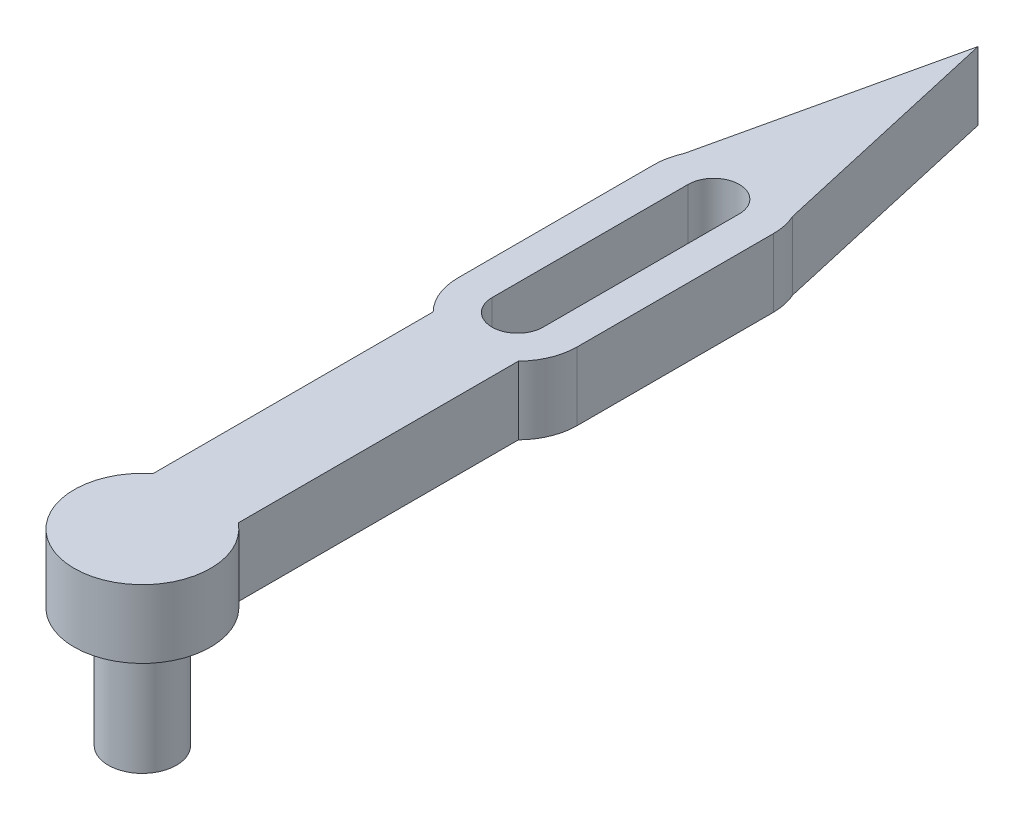
ISO-10303-21;
HEADER;
FILE_DESCRIPTION(('STEP AP214'),'2;1');
FILE_NAME('part.step','',(''),(''),'','','');
FILE_SCHEMA(('AUTOMOTIVE_DESIGN { 1 0 10303 214 1 1 1 1 }'));
ENDSEC;
DATA;
#1=APPLICATION_CONTEXT('core data for automotive mechanical design processes');
#2=APPLICATION_PROTOCOL_DEFINITION('international standard','automotive_design',2000,#1);
#3=PRODUCT_CONTEXT('',#1,'mechanical');
#4=PRODUCT('Part','Part','',(#3));
#5=PRODUCT_RELATED_PRODUCT_CATEGORY('part','',(#4));
#6=PRODUCT_DEFINITION_FORMATION('','',#4);
#7=PRODUCT_DEFINITION_CONTEXT('part definition',#1,'design');
#8=PRODUCT_DEFINITION('design','',#6,#7);
#9=PRODUCT_DEFINITION_SHAPE('','',#8);
#10=(LENGTH_UNIT() NAMED_UNIT(*) SI_UNIT(.MILLI.,.METRE.));
#11=(NAMED_UNIT(*) PLANE_ANGLE_UNIT() SI_UNIT($,.RADIAN.));
#12=(NAMED_UNIT(*) SI_UNIT($,.STERADIAN.) SOLID_ANGLE_UNIT());
#13=UNCERTAINTY_MEASURE_WITH_UNIT(LENGTH_MEASURE(1.E-05),#10,'distance_accuracy_value','');
#14=(GEOMETRIC_REPRESENTATION_CONTEXT(3) GLOBAL_UNCERTAINTY_ASSIGNED_CONTEXT((#13)) GLOBAL_UNIT_ASSIGNED_CONTEXT((#10,
#11,#12)) REPRESENTATION_CONTEXT('',''));
#15=CARTESIAN_POINT('',(0.,0.,0.));
#16=DIRECTION('',(0.,0.,1.));
#17=DIRECTION('',(1.,0.,0.));
#18=AXIS2_PLACEMENT_3D('',#15,#16,#17);
#19=CARTESIAN_POINT('',(0.,0.,-67.));
#20=DIRECTION('',(0.,-1.,0.));
#21=DIRECTION('',(0.,0.,-1.));
#22=AXIS2_PLACEMENT_3D('',#19,#20,#21);
#23=PLANE('',#22);
#24=DIRECTION('',(0.,0.,-1.));
#25=VECTOR('',#24,1.);
#26=CARTESIAN_POINT('',(3.,0.,-67.));
#27=LINE('',#26,#25);
#28=CARTESIAN_POINT('',(3.,0.,-44.));
#29=VERTEX_POINT('',#28);
#30=CARTESIAN_POINT('',(3.,0.,-67.));
#31=VERTEX_POINT('',#30);
#32=EDGE_CURVE('E149',#29,#31,#27,.T.);
#33=ORIENTED_EDGE('',*,*,#32,.T.);
#34=CARTESIAN_POINT('',(0.,0.,-67.));
#35=DIRECTION('',(0.,1.,0.));
#36=DIRECTION('',(0.,0.,1.));
#37=AXIS2_PLACEMENT_3D('',#34,#35,#36);
#38=CIRCLE('',#37,3.);
#39=CARTESIAN_POINT('',(-3.,0.,-67.));
#40=VERTEX_POINT('',#39);
#41=EDGE_CURVE('E56',#31,#40,#38,.T.);
#42=ORIENTED_EDGE('',*,*,#41,.T.);
#43=DIRECTION('',(0.,0.,1.));
#44=VECTOR('',#43,1.);
#45=CARTESIAN_POINT('',(-3.,0.,-67.));
#46=LINE('',#45,#44);
#47=CARTESIAN_POINT('',(-3.,0.,-44.));
#48=VERTEX_POINT('',#47);
#49=EDGE_CURVE('E155',#40,#48,#46,.T.);
#50=ORIENTED_EDGE('',*,*,#49,.T.);
#51=CARTESIAN_POINT('',(0.,0.,-44.));
#52=DIRECTION('',(0.,1.,0.));
#53=DIRECTION('',(0.,0.,1.));
#54=AXIS2_PLACEMENT_3D('',#51,#52,#53);
#55=CIRCLE('',#54,3.);
#56=EDGE_CURVE('E171',#48,#29,#55,.T.);
#57=ORIENTED_EDGE('',*,*,#56,.T.);
#58=EDGE_LOOP('',(#33,#42,#50,#57));
#59=FACE_BOUND('',#58,.T.);
#60=DIRECTION('',(-0.221230674548458,0.,-0.975221507473474));
#61=VECTOR('',#60,1.);
#62=CARTESIAN_POINT('',(6.37803807647604,0.,-69.8845502760434));
#63=LINE('',#62,#61);
#64=CARTESIAN_POINT('',(6.37803807647603,0.,-69.8845502760434));
#65=VERTEX_POINT('',#64);
#66=CARTESIAN_POINT('',(0.,0.,-98.));
#67=VERTEX_POINT('',#66);
#68=EDGE_CURVE('E156',#65,#67,#63,.T.);
#69=ORIENTED_EDGE('',*,*,#68,.F.);
#70=CARTESIAN_POINT('',(0.,0.,-67.));
#71=DIRECTION('',(0.,1.,0.));
#72=DIRECTION('',(0.,0.,1.));
#73=AXIS2_PLACEMENT_3D('',#70,#71,#72);
#74=CIRCLE('',#73,7.);
#75=CARTESIAN_POINT('',(7.,0.,-67.));
#76=VERTEX_POINT('',#75);
#77=EDGE_CURVE('E183',#76,#65,#74,.T.);
#78=ORIENTED_EDGE('',*,*,#77,.F.);
#79=DIRECTION('',(0.,0.,-1.));
#80=VECTOR('',#79,1.);
#81=CARTESIAN_POINT('',(7.,0.,-44.));
#82=LINE('',#81,#80);
#83=CARTESIAN_POINT('',(7.,0.,-44.));
#84=VERTEX_POINT('',#83);
#85=EDGE_CURVE('E222',#84,#76,#82,.T.);
#86=ORIENTED_EDGE('',*,*,#85,.F.);
#87=CARTESIAN_POINT('',(0.,0.,-44.));
#88=DIRECTION('',(0.,1.,0.));
#89=DIRECTION('',(0.,0.,-1.));
#90=AXIS2_PLACEMENT_3D('',#87,#88,#89);
#91=CIRCLE('',#90,7.);
#92=CARTESIAN_POINT('',(5.,0.,-39.1010205144336));
#93=VERTEX_POINT('',#92);
#94=EDGE_CURVE('E220',#93,#84,#91,.T.);
#95=ORIENTED_EDGE('',*,*,#94,.F.);
#96=DIRECTION('',(0.,0.,-1.));
#97=VECTOR('',#96,1.);
#98=CARTESIAN_POINT('',(5.,0.,-6.2449979983984));
#99=LINE('',#98,#97);
#100=CARTESIAN_POINT('',(5.,0.,-6.2449979983984));
#101=VERTEX_POINT('',#100);
#102=EDGE_CURVE('E218',#101,#93,#99,.T.);
#103=ORIENTED_EDGE('',*,*,#102,.F.);
#104=CARTESIAN_POINT('',(0.,0.,0.));
#105=DIRECTION('',(0.,1.,0.));
#106=DIRECTION('',(0.,0.,1.));
#107=AXIS2_PLACEMENT_3D('',#104,#105,#106);
#108=CIRCLE('',#107,8.);
#109=CARTESIAN_POINT('',(-5.,0.,-6.2449979983984));
#110=VERTEX_POINT('',#109);
#111=EDGE_CURVE('E216',#110,#101,#108,.T.);
#112=ORIENTED_EDGE('',*,*,#111,.F.);
#113=DIRECTION('',(0.,0.,1.));
#114=VECTOR('',#113,1.);
#115=CARTESIAN_POINT('',(-5.,0.,-6.2449979983984));
#116=LINE('',#115,#114);
#117=CARTESIAN_POINT('',(-5.,0.,-39.1010205144336));
#118=VERTEX_POINT('',#117);
#119=EDGE_CURVE('E214',#118,#110,#116,.T.);
#120=ORIENTED_EDGE('',*,*,#119,.F.);
#121=CARTESIAN_POINT('',(0.,0.,-44.));
#122=DIRECTION('',(0.,1.,0.));
#123=DIRECTION('',(0.,0.,1.));
#124=AXIS2_PLACEMENT_3D('',#121,#122,#123);
#125=CIRCLE('',#124,7.);
#126=CARTESIAN_POINT('',(-7.,0.,-44.));
#127=VERTEX_POINT('',#126);
#128=EDGE_CURVE('E212',#127,#118,#125,.T.);
#129=ORIENTED_EDGE('',*,*,#128,.F.);
#130=DIRECTION('',(0.,0.,1.));
#131=VECTOR('',#130,1.);
#132=CARTESIAN_POINT('',(-7.,0.,-44.));
#133=LINE('',#132,#131);
#134=CARTESIAN_POINT('',(-7.,0.,-67.));
#135=VERTEX_POINT('',#134);
#136=EDGE_CURVE('E210',#135,#127,#133,.T.);
#137=ORIENTED_EDGE('',*,*,#136,.F.);
#138=CARTESIAN_POINT('',(0.,0.,-67.));
#139=DIRECTION('',(0.,1.,0.));
#140=DIRECTION('',(0.,0.,-1.));
#141=AXIS2_PLACEMENT_3D('',#138,#139,#140);
#142=CIRCLE('',#141,7.);
#143=CARTESIAN_POINT('',(-6.37803807647604,0.,-69.8845502760434));
#144=VERTEX_POINT('',#143);
#145=EDGE_CURVE('E208',#144,#135,#142,.T.);
#146=ORIENTED_EDGE('',*,*,#145,.F.);
#147=DIRECTION('',(-0.221230674548458,0.,0.975221507473474));
#148=VECTOR('',#147,1.);
#149=CARTESIAN_POINT('',(-6.37803807647604,0.,-69.8845502760434));
#150=LINE('',#149,#148);
#151=EDGE_CURVE('E206',#67,#144,#150,.T.);
#152=ORIENTED_EDGE('',*,*,#151,.F.);
#153=EDGE_LOOP('',(#69,#78,#86,#95,#103,#112,#120,#129,#137,#146,#152));
#154=FACE_BOUND('',#153,.T.);
#155=CARTESIAN_POINT('',(0.,0.,0.));
#156=DIRECTION('',(0.,-1.,0.));
#157=DIRECTION('',(0.,0.,-1.));
#158=AXIS2_PLACEMENT_3D('',#155,#156,#157);
#159=CIRCLE('',#158,4.);
#160=CARTESIAN_POINT('',(0.,0.,-4.));
#161=VERTEX_POINT('',#160);
#162=EDGE_CURVE('E466',#161,#161,#159,.T.);
#163=ORIENTED_EDGE('',*,*,#162,.F.);
#164=EDGE_LOOP('',(#163));
#165=FACE_BOUND('',#164,.T.);
#166=ADVANCED_FACE('F33',(#59,#154,#165),#23,.T.);
#167=CARTESIAN_POINT('',(0.,8.,-67.));
#168=DIRECTION('',(0.,-1.,0.));
#169=DIRECTION('',(0.,0.,-1.));
#170=AXIS2_PLACEMENT_3D('',#167,#168,#169);
#171=PLANE('',#170);
#172=DIRECTION('',(-0.221230674548458,0.,-0.975221507473474));
#173=VECTOR('',#172,1.);
#174=CARTESIAN_POINT('',(6.37803807647604,8.,-69.8845502760434));
#175=LINE('',#174,#173);
#176=CARTESIAN_POINT('',(6.37803807647603,8.,-69.8845502760434));
#177=VERTEX_POINT('',#176);
#178=CARTESIAN_POINT('',(0.,8.,-98.));
#179=VERTEX_POINT('',#178);
#180=EDGE_CURVE('E179',#177,#179,#175,.T.);
#181=ORIENTED_EDGE('',*,*,#180,.T.);
#182=DIRECTION('',(-0.221230674548458,0.,0.975221507473474));
#183=VECTOR('',#182,1.);
#184=CARTESIAN_POINT('',(-6.37803807647604,8.,-69.8845502760434));
#185=LINE('',#184,#183);
#186=CARTESIAN_POINT('',(-6.37803807647604,8.,-69.8845502760434));
#187=VERTEX_POINT('',#186);
#188=EDGE_CURVE('E182',#179,#187,#185,.T.);
#189=ORIENTED_EDGE('',*,*,#188,.T.);
#190=CARTESIAN_POINT('',(0.,8.,-67.));
#191=DIRECTION('',(0.,1.,0.));
#192=DIRECTION('',(0.,0.,-1.));
#193=AXIS2_PLACEMENT_3D('',#190,#191,#192);
#194=CIRCLE('',#193,7.);
#195=CARTESIAN_POINT('',(-7.,8.,-67.));
#196=VERTEX_POINT('',#195);
#197=EDGE_CURVE('E185',#187,#196,#194,.T.);
#198=ORIENTED_EDGE('',*,*,#197,.T.);
#199=DIRECTION('',(0.,0.,1.));
#200=VECTOR('',#199,1.);
#201=CARTESIAN_POINT('',(-7.,8.,-44.));
#202=LINE('',#201,#200);
#203=CARTESIAN_POINT('',(-7.,8.,-44.));
#204=VERTEX_POINT('',#203);
#205=EDGE_CURVE('E187',#196,#204,#202,.T.);
#206=ORIENTED_EDGE('',*,*,#205,.T.);
#207=CARTESIAN_POINT('',(0.,8.,-44.));
#208=DIRECTION('',(0.,1.,0.));
#209=DIRECTION('',(0.,0.,1.));
#210=AXIS2_PLACEMENT_3D('',#207,#208,#209);
#211=CIRCLE('',#210,7.);
#212=CARTESIAN_POINT('',(-5.,8.,-39.1010205144336));
#213=VERTEX_POINT('',#212);
#214=EDGE_CURVE('E189',#204,#213,#211,.T.);
#215=ORIENTED_EDGE('',*,*,#214,.T.);
#216=DIRECTION('',(0.,0.,1.));
#217=VECTOR('',#216,1.);
#218=CARTESIAN_POINT('',(-5.,8.,-6.2449979983984));
#219=LINE('',#218,#217);
#220=CARTESIAN_POINT('',(-5.,8.,-6.2449979983984));
#221=VERTEX_POINT('',#220);
#222=EDGE_CURVE('E191',#213,#221,#219,.T.);
#223=ORIENTED_EDGE('',*,*,#222,.T.);
#224=CARTESIAN_POINT('',(0.,8.,0.));
#225=DIRECTION('',(0.,1.,0.));
#226=DIRECTION('',(0.,0.,1.));
#227=AXIS2_PLACEMENT_3D('',#224,#225,#226);
#228=CIRCLE('',#227,8.);
#229=CARTESIAN_POINT('',(5.,8.,-6.2449979983984));
#230=VERTEX_POINT('',#229);
#231=EDGE_CURVE('E193',#221,#230,#228,.T.);
#232=ORIENTED_EDGE('',*,*,#231,.T.);
#233=DIRECTION('',(0.,0.,-1.));
#234=VECTOR('',#233,1.);
#235=CARTESIAN_POINT('',(5.,8.,-6.2449979983984));
#236=LINE('',#235,#234);
#237=CARTESIAN_POINT('',(5.,8.,-39.1010205144336));
#238=VERTEX_POINT('',#237);
#239=EDGE_CURVE('E195',#230,#238,#236,.T.);
#240=ORIENTED_EDGE('',*,*,#239,.T.);
#241=CARTESIAN_POINT('',(0.,8.,-44.));
#242=DIRECTION('',(0.,1.,0.));
#243=DIRECTION('',(0.,0.,-1.));
#244=AXIS2_PLACEMENT_3D('',#241,#242,#243);
#245=CIRCLE('',#244,7.);
#246=CARTESIAN_POINT('',(7.,8.,-44.));
#247=VERTEX_POINT('',#246);
#248=EDGE_CURVE('E197',#238,#247,#245,.T.);
#249=ORIENTED_EDGE('',*,*,#248,.T.);
#250=DIRECTION('',(0.,0.,-1.));
#251=VECTOR('',#250,1.);
#252=CARTESIAN_POINT('',(7.,8.,-44.));
#253=LINE('',#252,#251);
#254=CARTESIAN_POINT('',(7.,8.,-67.));
#255=VERTEX_POINT('',#254);
#256=EDGE_CURVE('E199',#247,#255,#253,.T.);
#257=ORIENTED_EDGE('',*,*,#256,.T.);
#258=CARTESIAN_POINT('',(0.,8.,-67.));
#259=DIRECTION('',(0.,1.,0.));
#260=DIRECTION('',(0.,0.,1.));
#261=AXIS2_PLACEMENT_3D('',#258,#259,#260);
#262=CIRCLE('',#261,7.);
#263=EDGE_CURVE('E201',#255,#177,#262,.T.);
#264=ORIENTED_EDGE('',*,*,#263,.T.);
#265=EDGE_LOOP('',(#181,#189,#198,#206,#215,#223,#232,#240,#249,#257,#264));
#266=FACE_BOUND('',#265,.T.);
#267=CARTESIAN_POINT('',(0.,8.,-67.));
#268=DIRECTION('',(0.,1.,0.));
#269=DIRECTION('',(0.,0.,1.));
#270=AXIS2_PLACEMENT_3D('',#267,#268,#269);
#271=CIRCLE('',#270,3.);
#272=CARTESIAN_POINT('',(3.,8.,-67.));
#273=VERTEX_POINT('',#272);
#274=CARTESIAN_POINT('',(-3.,8.,-67.));
#275=VERTEX_POINT('',#274);
#276=EDGE_CURVE('E140',#273,#275,#271,.T.);
#277=ORIENTED_EDGE('',*,*,#276,.F.);
#278=DIRECTION('',(0.,0.,-1.));
#279=VECTOR('',#278,1.);
#280=CARTESIAN_POINT('',(3.,8.,-67.));
#281=LINE('',#280,#279);
#282=CARTESIAN_POINT('',(3.,8.,-44.));
#283=VERTEX_POINT('',#282);
#284=EDGE_CURVE('E163',#283,#273,#281,.T.);
#285=ORIENTED_EDGE('',*,*,#284,.F.);
#286=CARTESIAN_POINT('',(0.,8.,-44.));
#287=DIRECTION('',(0.,1.,0.));
#288=DIRECTION('',(0.,0.,1.));
#289=AXIS2_PLACEMENT_3D('',#286,#287,#288);
#290=CIRCLE('',#289,3.);
#291=CARTESIAN_POINT('',(-3.,8.,-44.));
#292=VERTEX_POINT('',#291);
#293=EDGE_CURVE('E161',#292,#283,#290,.T.);
#294=ORIENTED_EDGE('',*,*,#293,.F.);
#295=DIRECTION('',(0.,0.,1.));
#296=VECTOR('',#295,1.);
#297=CARTESIAN_POINT('',(-3.,8.,-67.));
#298=LINE('',#297,#296);
#299=EDGE_CURVE('E148',#275,#292,#298,.T.);
#300=ORIENTED_EDGE('',*,*,#299,.F.);
#301=EDGE_LOOP('',(#277,#285,#294,#300));
#302=FACE_BOUND('',#301,.T.);
#303=ADVANCED_FACE('F160',(#266,#302),#171,.F.);
#304=CARTESIAN_POINT('',(6.37803807647604,8.,-69.8845502760434));
#305=DIRECTION('',(-0.975221507473474,0.,0.221230674548458));
#306=DIRECTION('',(0.221230674548458,0.,0.975221507473474));
#307=AXIS2_PLACEMENT_3D('',#304,#305,#306);
#308=PLANE('',#307);
#309=ORIENTED_EDGE('',*,*,#68,.T.);
#310=DIRECTION('',(0.,-1.,0.));
#311=VECTOR('',#310,1.);
#312=CARTESIAN_POINT('',(0.,8.,-98.));
#313=LINE('',#312,#311);
#314=EDGE_CURVE('E11',#179,#67,#313,.T.);
#315=ORIENTED_EDGE('',*,*,#314,.F.);
#316=ORIENTED_EDGE('',*,*,#180,.F.);
#317=DIRECTION('',(0.,-1.,0.));
#318=VECTOR('',#317,1.);
#319=CARTESIAN_POINT('',(6.37803807647603,8.,-69.8845502760434));
#320=LINE('',#319,#318);
#321=EDGE_CURVE('E203',#177,#65,#320,.T.);
#322=ORIENTED_EDGE('',*,*,#321,.T.);
#323=EDGE_LOOP('',(#309,#315,#316,#322));
#324=FACE_BOUND('',#323,.T.);
#325=ADVANCED_FACE('F35',(#324),#308,.F.);
#326=CARTESIAN_POINT('',(-6.37803807647604,8.,-69.8845502760434));
#327=DIRECTION('',(0.975221507473474,0.,0.221230674548458));
#328=DIRECTION('',(0.221230674548458,0.,-0.975221507473474));
#329=AXIS2_PLACEMENT_3D('',#326,#327,#328);
#330=PLANE('',#329);
#331=ORIENTED_EDGE('',*,*,#151,.T.);
#332=DIRECTION('',(0.,-1.,0.));
#333=VECTOR('',#332,1.);
#334=CARTESIAN_POINT('',(-6.37803807647604,8.,-69.8845502760434));
#335=LINE('',#334,#333);
#336=EDGE_CURVE('E41',#187,#144,#335,.T.);
#337=ORIENTED_EDGE('',*,*,#336,.F.);
#338=ORIENTED_EDGE('',*,*,#188,.F.);
#339=ORIENTED_EDGE('',*,*,#314,.T.);
#340=EDGE_LOOP('',(#331,#337,#338,#339));
#341=FACE_BOUND('',#340,.T.);
#342=ADVANCED_FACE('F277',(#341),#330,.F.);
#343=CARTESIAN_POINT('',(0.,8.,-67.));
#344=DIRECTION('',(0.,-1.,0.));
#345=DIRECTION('',(0.,0.,-1.));
#346=AXIS2_PLACEMENT_3D('',#343,#344,#345);
#347=CYLINDRICAL_SURFACE('',#346,7.);
#348=ORIENTED_EDGE('',*,*,#145,.T.);
#349=DIRECTION('',(0.,-1.,0.));
#350=VECTOR('',#349,1.);
#351=CARTESIAN_POINT('',(-7.,8.,-67.));
#352=LINE('',#351,#350);
#353=EDGE_CURVE('E248',#196,#135,#352,.T.);
#354=ORIENTED_EDGE('',*,*,#353,.F.);
#355=ORIENTED_EDGE('',*,*,#197,.F.);
#356=ORIENTED_EDGE('',*,*,#336,.T.);
#357=EDGE_LOOP('',(#348,#354,#355,#356));
#358=FACE_BOUND('',#357,.T.);
#359=ADVANCED_FACE('F255',(#358),#347,.T.);
#360=CARTESIAN_POINT('',(-7.,8.,-44.));
#361=DIRECTION('',(1.,0.,0.));
#362=DIRECTION('',(0.,0.,-1.));
#363=AXIS2_PLACEMENT_3D('',#360,#361,#362);
#364=PLANE('',#363);
#365=ORIENTED_EDGE('',*,*,#136,.T.);
#366=DIRECTION('',(0.,-1.,0.));
#367=VECTOR('',#366,1.);
#368=CARTESIAN_POINT('',(-7.,8.,-44.));
#369=LINE('',#368,#367);
#370=EDGE_CURVE('E245',#204,#127,#369,.T.);
#371=ORIENTED_EDGE('',*,*,#370,.F.);
#372=ORIENTED_EDGE('',*,*,#205,.F.);
#373=ORIENTED_EDGE('',*,*,#353,.T.);
#374=EDGE_LOOP('',(#365,#371,#372,#373));
#375=FACE_BOUND('',#374,.T.);
#376=ADVANCED_FACE('F266',(#375),#364,.F.);
#377=CARTESIAN_POINT('',(0.,8.,-44.));
#378=DIRECTION('',(0.,-1.,0.));
#379=DIRECTION('',(0.,0.,-1.));
#380=AXIS2_PLACEMENT_3D('',#377,#378,#379);
#381=CYLINDRICAL_SURFACE('',#380,7.);
#382=ORIENTED_EDGE('',*,*,#128,.T.);
#383=DIRECTION('',(0.,-1.,0.));
#384=VECTOR('',#383,1.);
#385=CARTESIAN_POINT('',(-5.,8.,-39.1010205144336));
#386=LINE('',#385,#384);
#387=EDGE_CURVE('E242',#213,#118,#386,.T.);
#388=ORIENTED_EDGE('',*,*,#387,.F.);
#389=ORIENTED_EDGE('',*,*,#214,.F.);
#390=ORIENTED_EDGE('',*,*,#370,.T.);
#391=EDGE_LOOP('',(#382,#388,#389,#390));
#392=FACE_BOUND('',#391,.T.);
#393=ADVANCED_FACE('F270',(#392),#381,.T.);
#394=CARTESIAN_POINT('',(-5.,8.,-6.2449979983984));
#395=DIRECTION('',(1.,0.,0.));
#396=DIRECTION('',(0.,0.,-1.));
#397=AXIS2_PLACEMENT_3D('',#394,#395,#396);
#398=PLANE('',#397);
#399=ORIENTED_EDGE('',*,*,#119,.T.);
#400=DIRECTION('',(0.,-1.,0.));
#401=VECTOR('',#400,1.);
#402=CARTESIAN_POINT('',(-5.,8.,-6.2449979983984));
#403=LINE('',#402,#401);
#404=EDGE_CURVE('E239',#221,#110,#403,.T.);
#405=ORIENTED_EDGE('',*,*,#404,.F.);
#406=ORIENTED_EDGE('',*,*,#222,.F.);
#407=ORIENTED_EDGE('',*,*,#387,.T.);
#408=EDGE_LOOP('',(#399,#405,#406,#407));
#409=FACE_BOUND('',#408,.T.);
#410=ADVANCED_FACE('F305',(#409),#398,.F.);
#411=CARTESIAN_POINT('',(0.,8.,0.));
#412=DIRECTION('',(0.,-1.,0.));
#413=DIRECTION('',(0.,0.,-1.));
#414=AXIS2_PLACEMENT_3D('',#411,#412,#413);
#415=CYLINDRICAL_SURFACE('',#414,8.);
#416=ORIENTED_EDGE('',*,*,#111,.T.);
#417=DIRECTION('',(0.,-1.,0.));
#418=VECTOR('',#417,1.);
#419=CARTESIAN_POINT('',(5.,8.,-6.2449979983984));
#420=LINE('',#419,#418);
#421=EDGE_CURVE('E236',#230,#101,#420,.T.);
#422=ORIENTED_EDGE('',*,*,#421,.F.);
#423=ORIENTED_EDGE('',*,*,#231,.F.);
#424=ORIENTED_EDGE('',*,*,#404,.T.);
#425=EDGE_LOOP('',(#416,#422,#423,#424));
#426=FACE_BOUND('',#425,.T.);
#427=ADVANCED_FACE('F303',(#426),#415,.T.);
#428=CARTESIAN_POINT('',(5.,8.,-6.2449979983984));
#429=DIRECTION('',(-1.,0.,0.));
#430=DIRECTION('',(0.,0.,1.));
#431=AXIS2_PLACEMENT_3D('',#428,#429,#430);
#432=PLANE('',#431);
#433=ORIENTED_EDGE('',*,*,#102,.T.);
#434=DIRECTION('',(0.,-1.,0.));
#435=VECTOR('',#434,1.);
#436=CARTESIAN_POINT('',(5.,8.,-39.1010205144336));
#437=LINE('',#436,#435);
#438=EDGE_CURVE('E233',#238,#93,#437,.T.);
#439=ORIENTED_EDGE('',*,*,#438,.F.);
#440=ORIENTED_EDGE('',*,*,#239,.F.);
#441=ORIENTED_EDGE('',*,*,#421,.T.);
#442=EDGE_LOOP('',(#433,#439,#440,#441));
#443=FACE_BOUND('',#442,.T.);
#444=ADVANCED_FACE('F298',(#443),#432,.F.);
#445=CARTESIAN_POINT('',(0.,8.,-44.));
#446=DIRECTION('',(0.,-1.,0.));
#447=DIRECTION('',(0.,0.,-1.));
#448=AXIS2_PLACEMENT_3D('',#445,#446,#447);
#449=CYLINDRICAL_SURFACE('',#448,7.);
#450=ORIENTED_EDGE('',*,*,#94,.T.);
#451=DIRECTION('',(0.,-1.,0.));
#452=VECTOR('',#451,1.);
#453=CARTESIAN_POINT('',(7.,8.,-44.));
#454=LINE('',#453,#452);
#455=EDGE_CURVE('E230',#247,#84,#454,.T.);
#456=ORIENTED_EDGE('',*,*,#455,.F.);
#457=ORIENTED_EDGE('',*,*,#248,.F.);
#458=ORIENTED_EDGE('',*,*,#438,.T.);
#459=EDGE_LOOP('',(#450,#456,#457,#458));
#460=FACE_BOUND('',#459,.T.);
#461=ADVANCED_FACE('F293',(#460),#449,.T.);
#462=CARTESIAN_POINT('',(7.,8.,-44.));
#463=DIRECTION('',(-1.,0.,0.));
#464=DIRECTION('',(0.,0.,1.));
#465=AXIS2_PLACEMENT_3D('',#462,#463,#464);
#466=PLANE('',#465);
#467=ORIENTED_EDGE('',*,*,#85,.T.);
#468=DIRECTION('',(0.,-1.,0.));
#469=VECTOR('',#468,1.);
#470=CARTESIAN_POINT('',(7.,8.,-67.));
#471=LINE('',#470,#469);
#472=EDGE_CURVE('E227',#255,#76,#471,.T.);
#473=ORIENTED_EDGE('',*,*,#472,.F.);
#474=ORIENTED_EDGE('',*,*,#256,.F.);
#475=ORIENTED_EDGE('',*,*,#455,.T.);
#476=EDGE_LOOP('',(#467,#473,#474,#475));
#477=FACE_BOUND('',#476,.T.);
#478=ADVANCED_FACE('F289',(#477),#466,.F.);
#479=CARTESIAN_POINT('',(0.,8.,-67.));
#480=DIRECTION('',(0.,-1.,0.));
#481=DIRECTION('',(0.,0.,-1.));
#482=AXIS2_PLACEMENT_3D('',#479,#480,#481);
#483=CYLINDRICAL_SURFACE('',#482,7.);
#484=ORIENTED_EDGE('',*,*,#77,.T.);
#485=ORIENTED_EDGE('',*,*,#321,.F.);
#486=ORIENTED_EDGE('',*,*,#263,.F.);
#487=ORIENTED_EDGE('',*,*,#472,.T.);
#488=EDGE_LOOP('',(#484,#485,#486,#487));
#489=FACE_BOUND('',#488,.T.);
#490=ADVANCED_FACE('F284',(#489),#483,.T.);
#491=CARTESIAN_POINT('',(0.,8.,-67.));
#492=DIRECTION('',(0.,-1.,0.));
#493=DIRECTION('',(0.,0.,-1.));
#494=AXIS2_PLACEMENT_3D('',#491,#492,#493);
#495=CYLINDRICAL_SURFACE('',#494,3.);
#496=ORIENTED_EDGE('',*,*,#41,.F.);
#497=DIRECTION('',(0.,-1.,0.));
#498=VECTOR('',#497,1.);
#499=CARTESIAN_POINT('',(3.,8.,-67.));
#500=LINE('',#499,#498);
#501=EDGE_CURVE('E144',#273,#31,#500,.T.);
#502=ORIENTED_EDGE('',*,*,#501,.F.);
#503=ORIENTED_EDGE('',*,*,#276,.T.);
#504=DIRECTION('',(0.,-1.,0.));
#505=VECTOR('',#504,1.);
#506=CARTESIAN_POINT('',(-3.,8.,-67.));
#507=LINE('',#506,#505);
#508=EDGE_CURVE('E143',#275,#40,#507,.T.);
#509=ORIENTED_EDGE('',*,*,#508,.T.);
#510=EDGE_LOOP('',(#496,#502,#503,#509));
#511=FACE_BOUND('',#510,.T.);
#512=ADVANCED_FACE('F142',(#511),#495,.F.);
#513=CARTESIAN_POINT('',(-3.,8.,-67.));
#514=DIRECTION('',(1.,0.,0.));
#515=DIRECTION('',(0.,0.,-1.));
#516=AXIS2_PLACEMENT_3D('',#513,#514,#515);
#517=PLANE('',#516);
#518=ORIENTED_EDGE('',*,*,#49,.F.);
#519=ORIENTED_EDGE('',*,*,#508,.F.);
#520=ORIENTED_EDGE('',*,*,#299,.T.);
#521=DIRECTION('',(0.,-1.,0.));
#522=VECTOR('',#521,1.);
#523=CARTESIAN_POINT('',(-3.,8.,-44.));
#524=LINE('',#523,#522);
#525=EDGE_CURVE('E157',#292,#48,#524,.T.);
#526=ORIENTED_EDGE('',*,*,#525,.T.);
#527=EDGE_LOOP('',(#518,#519,#520,#526));
#528=FACE_BOUND('',#527,.T.);
#529=ADVANCED_FACE('F152',(#528),#517,.T.);
#530=CARTESIAN_POINT('',(0.,8.,-44.));
#531=DIRECTION('',(0.,-1.,0.));
#532=DIRECTION('',(0.,0.,-1.));
#533=AXIS2_PLACEMENT_3D('',#530,#531,#532);
#534=CYLINDRICAL_SURFACE('',#533,3.);
#535=ORIENTED_EDGE('',*,*,#56,.F.);
#536=ORIENTED_EDGE('',*,*,#525,.F.);
#537=ORIENTED_EDGE('',*,*,#293,.T.);
#538=DIRECTION('',(0.,-1.,0.));
#539=VECTOR('',#538,1.);
#540=CARTESIAN_POINT('',(3.,8.,-44.));
#541=LINE('',#540,#539);
#542=EDGE_CURVE('E48',#283,#29,#541,.T.);
#543=ORIENTED_EDGE('',*,*,#542,.T.);
#544=EDGE_LOOP('',(#535,#536,#537,#543));
#545=FACE_BOUND('',#544,.T.);
#546=ADVANCED_FACE('F357',(#545),#534,.F.);
#547=CARTESIAN_POINT('',(3.,8.,-67.));
#548=DIRECTION('',(-1.,0.,0.));
#549=DIRECTION('',(0.,0.,1.));
#550=AXIS2_PLACEMENT_3D('',#547,#548,#549);
#551=PLANE('',#550);
#552=ORIENTED_EDGE('',*,*,#32,.F.);
#553=ORIENTED_EDGE('',*,*,#542,.F.);
#554=ORIENTED_EDGE('',*,*,#284,.T.);
#555=ORIENTED_EDGE('',*,*,#501,.T.);
#556=EDGE_LOOP('',(#552,#553,#554,#555));
#557=FACE_BOUND('',#556,.T.);
#558=ADVANCED_FACE('F364',(#557),#551,.T.);
#559=CARTESIAN_POINT('',(0.,-14.,0.));
#560=DIRECTION('',(0.,1.,0.));
#561=DIRECTION('',(0.,0.,1.));
#562=AXIS2_PLACEMENT_3D('',#559,#560,#561);
#563=CYLINDRICAL_SURFACE('',#562,4.);
#564=CARTESIAN_POINT('',(0.,-14.,0.));
#565=DIRECTION('',(0.,-1.,0.));
#566=DIRECTION('',(0.,0.,-1.));
#567=AXIS2_PLACEMENT_3D('',#564,#565,#566);
#568=CIRCLE('',#567,4.);
#569=CARTESIAN_POINT('',(0.,-14.,-4.));
#570=VERTEX_POINT('',#569);
#571=EDGE_CURVE('E169',#570,#570,#568,.T.);
#572=ORIENTED_EDGE('',*,*,#571,.F.);
#573=EDGE_LOOP('',(#572));
#574=FACE_BOUND('',#573,.T.);
#575=ORIENTED_EDGE('',*,*,#162,.T.);
#576=EDGE_LOOP('',(#575));
#577=FACE_BOUND('',#576,.T.);
#578=ADVANCED_FACE('F372',(#574,#577),#563,.T.);
#579=CARTESIAN_POINT('',(0.,-14.,0.));
#580=DIRECTION('',(0.,-1.,0.));
#581=DIRECTION('',(0.,0.,-1.));
#582=AXIS2_PLACEMENT_3D('',#579,#580,#581);
#583=PLANE('',#582);
#584=ORIENTED_EDGE('',*,*,#571,.T.);
#585=EDGE_LOOP('',(#584));
#586=FACE_BOUND('',#585,.T.);
#587=ADVANCED_FACE('F379',(#586),#583,.T.);
#588=CLOSED_SHELL('',(#166,#303,#325,#342,#359,#376,#393,#410,#427,#444,#461,#478,#490,#512,
#529,#546,#558,#578,#587));
#589=MANIFOLD_SOLID_BREP('B2',#588);
#590=ADVANCED_BREP_SHAPE_REPRESENTATION('',(#18,#589),#14);
#591=SHAPE_DEFINITION_REPRESENTATION(#9,#590);
ENDSEC;
END-ISO-10303-21;
